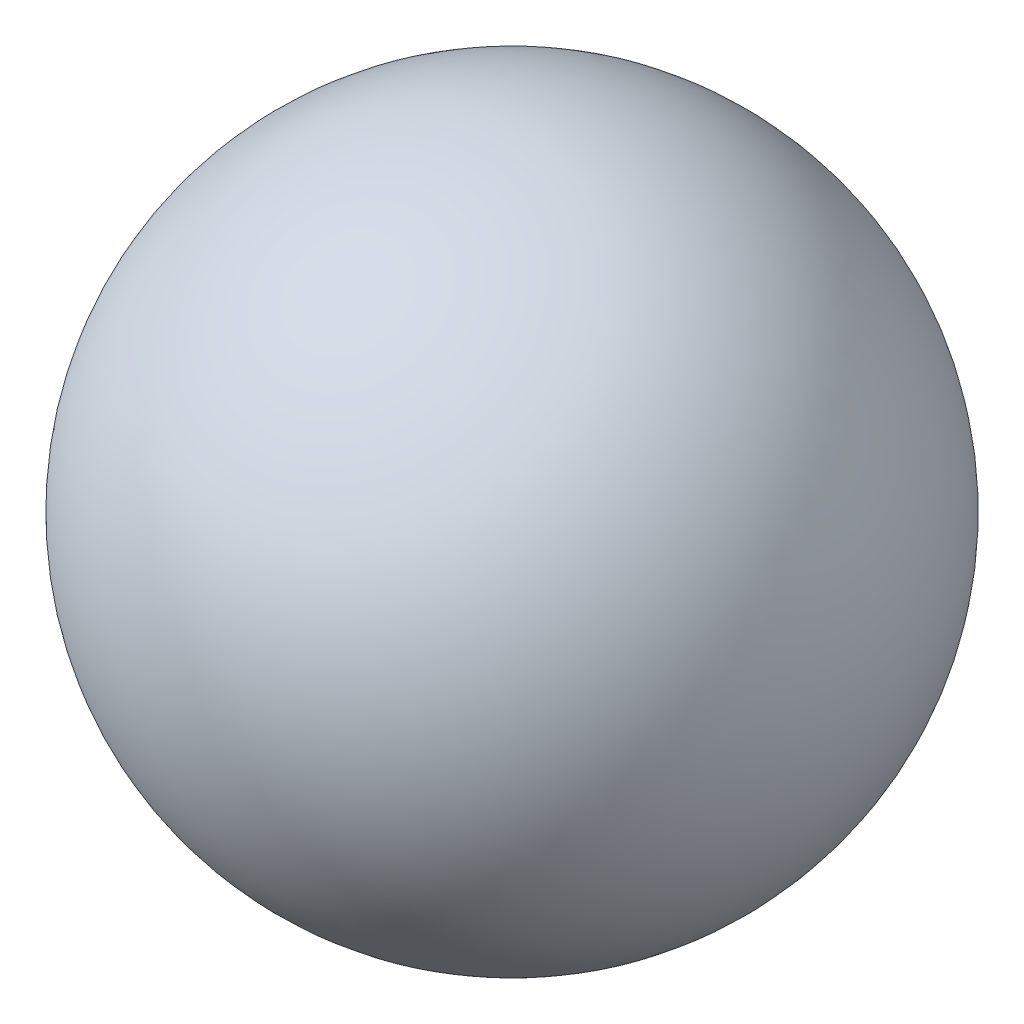
ISO-10303-21;
HEADER;
FILE_DESCRIPTION(('STEP AP214'),'2;1');
FILE_NAME('part.step','',(''),(''),'','','');
FILE_SCHEMA(('AUTOMOTIVE_DESIGN { 1 0 10303 214 1 1 1 1 }'));
ENDSEC;
DATA;
#1=APPLICATION_CONTEXT('core data for automotive mechanical design processes');
#2=APPLICATION_PROTOCOL_DEFINITION('international standard','automotive_design',2000,#1);
#3=PRODUCT_CONTEXT('',#1,'mechanical');
#4=PRODUCT('Part','Part','',(#3));
#5=PRODUCT_RELATED_PRODUCT_CATEGORY('part','',(#4));
#6=PRODUCT_DEFINITION_FORMATION('','',#4);
#7=PRODUCT_DEFINITION_CONTEXT('part definition',#1,'design');
#8=PRODUCT_DEFINITION('design','',#6,#7);
#9=PRODUCT_DEFINITION_SHAPE('','',#8);
#10=(LENGTH_UNIT() NAMED_UNIT(*) SI_UNIT(.MILLI.,.METRE.));
#11=(NAMED_UNIT(*) PLANE_ANGLE_UNIT() SI_UNIT($,.RADIAN.));
#12=(NAMED_UNIT(*) SI_UNIT($,.STERADIAN.) SOLID_ANGLE_UNIT());
#13=UNCERTAINTY_MEASURE_WITH_UNIT(LENGTH_MEASURE(1.E-05),#10,'distance_accuracy_value','');
#14=(GEOMETRIC_REPRESENTATION_CONTEXT(3) GLOBAL_UNCERTAINTY_ASSIGNED_CONTEXT((#13)) GLOBAL_UNIT_ASSIGNED_CONTEXT((#10,
#11,#12)) REPRESENTATION_CONTEXT('',''));
#15=CARTESIAN_POINT('',(0.,0.,0.));
#16=DIRECTION('',(0.,0.,1.));
#17=DIRECTION('',(1.,0.,0.));
#18=AXIS2_PLACEMENT_3D('',#15,#16,#17);
#19=CARTESIAN_POINT('',(0.,0.,0.));
#20=DIRECTION('',(0.,1.,0.));
#21=DIRECTION('',(1.,0.,0.));
#22=AXIS2_PLACEMENT_3D('',#19,#20,#21);
#23=SPHERICAL_SURFACE('',#22,40.);
#24=CARTESIAN_POINT('',(0.,40.,0.));
#25=VERTEX_POINT('',#24);
#26=VERTEX_LOOP('',#25);
#27=FACE_BOUND('',#26,.T.);
#28=ADVANCED_FACE('F28',(#27),#23,.T.);
#29=CLOSED_SHELL('',(#28));
#30=MANIFOLD_SOLID_BREP('B2',#29);
#31=ADVANCED_BREP_SHAPE_REPRESENTATION('',(#18,#30),#14);
#32=SHAPE_DEFINITION_REPRESENTATION(#9,#31);
ENDSEC;
END-ISO-10303-21;
